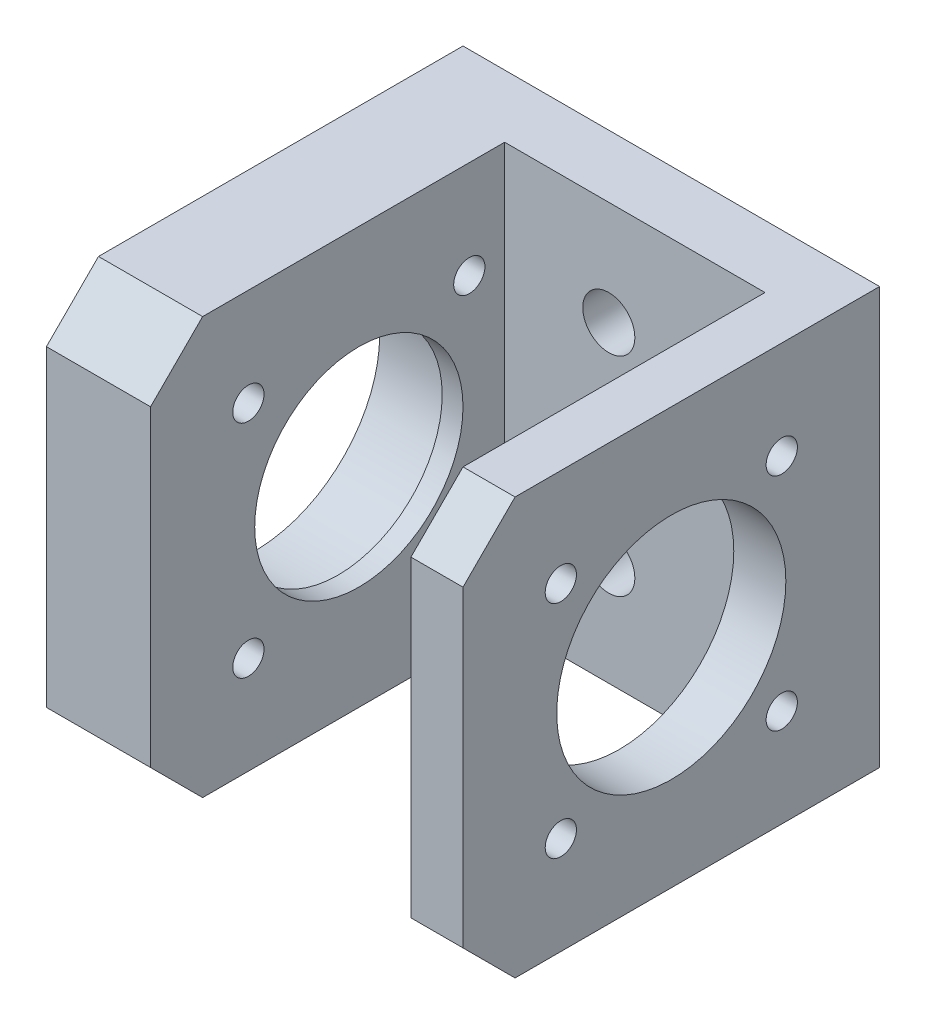
ISO-10303-21;
HEADER;
FILE_DESCRIPTION(('STEP AP214'),'2;1');
FILE_NAME('part.step','',(''),(''),'','','');
FILE_SCHEMA(('AUTOMOTIVE_DESIGN { 1 0 10303 214 1 1 1 1 }'));
ENDSEC;
DATA;
#1=APPLICATION_CONTEXT('core data for automotive mechanical design processes');
#2=APPLICATION_PROTOCOL_DEFINITION('international standard','automotive_design',2000,#1);
#3=PRODUCT_CONTEXT('',#1,'mechanical');
#4=PRODUCT('Part','Part','',(#3));
#5=PRODUCT_RELATED_PRODUCT_CATEGORY('part','',(#4));
#6=PRODUCT_DEFINITION_FORMATION('','',#4);
#7=PRODUCT_DEFINITION_CONTEXT('part definition',#1,'design');
#8=PRODUCT_DEFINITION('design','',#6,#7);
#9=PRODUCT_DEFINITION_SHAPE('','',#8);
#10=(LENGTH_UNIT() NAMED_UNIT(*) SI_UNIT(.MILLI.,.METRE.));
#11=(NAMED_UNIT(*) PLANE_ANGLE_UNIT() SI_UNIT($,.RADIAN.));
#12=(NAMED_UNIT(*) SI_UNIT($,.STERADIAN.) SOLID_ANGLE_UNIT());
#13=UNCERTAINTY_MEASURE_WITH_UNIT(LENGTH_MEASURE(1.E-05),#10,'distance_accuracy_value','');
#14=(GEOMETRIC_REPRESENTATION_CONTEXT(3) GLOBAL_UNCERTAINTY_ASSIGNED_CONTEXT((#13)) GLOBAL_UNIT_ASSIGNED_CONTEXT((#10,
#11,#12)) REPRESENTATION_CONTEXT('',''));
#15=CARTESIAN_POINT('',(0.,0.,0.));
#16=DIRECTION('',(0.,0.,1.));
#17=DIRECTION('',(1.,0.,0.));
#18=AXIS2_PLACEMENT_3D('',#15,#16,#17);
#19=CARTESIAN_POINT('',(-20.,20.,40.));
#20=DIRECTION('',(0.,-1.,0.));
#21=DIRECTION('',(0.,0.,-1.));
#22=AXIS2_PLACEMENT_3D('',#19,#20,#21);
#23=PLANE('',#22);
#24=DIRECTION('',(0.,0.,1.));
#25=VECTOR('',#24,1.);
#26=CARTESIAN_POINT('',(15.,20.,6.));
#27=LINE('',#26,#25);
#28=CARTESIAN_POINT('',(15.,20.,6.));
#29=VERTEX_POINT('',#28);
#30=CARTESIAN_POINT('',(15.,20.,35.));
#31=VERTEX_POINT('',#30);
#32=EDGE_CURVE('E162',#29,#31,#27,.T.);
#33=ORIENTED_EDGE('',*,*,#32,.T.);
#34=DIRECTION('',(1.,0.,0.));
#35=VECTOR('',#34,1.);
#36=CARTESIAN_POINT('',(-20.,20.,35.));
#37=LINE('',#36,#35);
#38=CARTESIAN_POINT('',(20.,20.,35.));
#39=VERTEX_POINT('',#38);
#40=EDGE_CURVE('E11',#31,#39,#37,.T.);
#41=ORIENTED_EDGE('',*,*,#40,.T.);
#42=DIRECTION('',(0.,0.,-1.));
#43=VECTOR('',#42,1.);
#44=CARTESIAN_POINT('',(20.,20.,40.));
#45=LINE('',#44,#43);
#46=CARTESIAN_POINT('',(20.,20.,0.));
#47=VERTEX_POINT('',#46);
#48=EDGE_CURVE('E175',#39,#47,#45,.T.);
#49=ORIENTED_EDGE('',*,*,#48,.T.);
#50=DIRECTION('',(-1.,0.,0.));
#51=VECTOR('',#50,1.);
#52=CARTESIAN_POINT('',(-20.,20.,0.));
#53=LINE('',#52,#51);
#54=CARTESIAN_POINT('',(-20.,20.,0.));
#55=VERTEX_POINT('',#54);
#56=EDGE_CURVE('E161',#47,#55,#53,.T.);
#57=ORIENTED_EDGE('',*,*,#56,.T.);
#58=DIRECTION('',(0.,0.,-1.));
#59=VECTOR('',#58,1.);
#60=CARTESIAN_POINT('',(-20.,20.,40.));
#61=LINE('',#60,#59);
#62=CARTESIAN_POINT('',(-20.,20.,35.));
#63=VERTEX_POINT('',#62);
#64=EDGE_CURVE('E173',#63,#55,#61,.T.);
#65=ORIENTED_EDGE('',*,*,#64,.F.);
#66=DIRECTION('',(1.,0.,0.));
#67=VECTOR('',#66,1.);
#68=CARTESIAN_POINT('',(-20.,20.,35.));
#69=LINE('',#68,#67);
#70=CARTESIAN_POINT('',(-10.,20.,35.));
#71=VERTEX_POINT('',#70);
#72=EDGE_CURVE('E41',#63,#71,#69,.T.);
#73=ORIENTED_EDGE('',*,*,#72,.T.);
#74=DIRECTION('',(0.,0.,1.));
#75=VECTOR('',#74,1.);
#76=CARTESIAN_POINT('',(-10.,20.,6.));
#77=LINE('',#76,#75);
#78=CARTESIAN_POINT('',(-10.,20.,6.));
#79=VERTEX_POINT('',#78);
#80=EDGE_CURVE('E126',#79,#71,#77,.T.);
#81=ORIENTED_EDGE('',*,*,#80,.F.);
#82=DIRECTION('',(-1.,0.,0.));
#83=VECTOR('',#82,1.);
#84=CARTESIAN_POINT('',(0.,20.,6.));
#85=LINE('',#84,#83);
#86=EDGE_CURVE('E134',#29,#79,#85,.T.);
#87=ORIENTED_EDGE('',*,*,#86,.F.);
#88=EDGE_LOOP('',(#33,#41,#49,#57,#65,#73,#81,#87));
#89=FACE_BOUND('',#88,.T.);
#90=ADVANCED_FACE('F32',(#89),#23,.F.);
#91=CARTESIAN_POINT('',(-20.,-20.,40.));
#92=DIRECTION('',(0.,1.,0.));
#93=DIRECTION('',(0.,0.,1.));
#94=AXIS2_PLACEMENT_3D('',#91,#92,#93);
#95=PLANE('',#94);
#96=DIRECTION('',(0.,0.,1.));
#97=VECTOR('',#96,1.);
#98=CARTESIAN_POINT('',(-9.99999999999999,-20.,6.));
#99=LINE('',#98,#97);
#100=CARTESIAN_POINT('',(-9.99999999999999,-20.,6.));
#101=VERTEX_POINT('',#100);
#102=CARTESIAN_POINT('',(-9.99999999999999,-20.,35.));
#103=VERTEX_POINT('',#102);
#104=EDGE_CURVE('E129',#101,#103,#99,.T.);
#105=ORIENTED_EDGE('',*,*,#104,.T.);
#106=DIRECTION('',(-1.,0.,0.));
#107=VECTOR('',#106,1.);
#108=CARTESIAN_POINT('',(-20.,-20.,35.));
#109=LINE('',#108,#107);
#110=CARTESIAN_POINT('',(-20.,-20.,35.));
#111=VERTEX_POINT('',#110);
#112=EDGE_CURVE('E189',#103,#111,#109,.T.);
#113=ORIENTED_EDGE('',*,*,#112,.T.);
#114=DIRECTION('',(0.,0.,-1.));
#115=VECTOR('',#114,1.);
#116=CARTESIAN_POINT('',(-20.,-20.,40.));
#117=LINE('',#116,#115);
#118=CARTESIAN_POINT('',(-20.,-20.,0.));
#119=VERTEX_POINT('',#118);
#120=EDGE_CURVE('E171',#111,#119,#117,.T.);
#121=ORIENTED_EDGE('',*,*,#120,.T.);
#122=DIRECTION('',(1.,0.,0.));
#123=VECTOR('',#122,1.);
#124=CARTESIAN_POINT('',(-20.,-20.,0.));
#125=LINE('',#124,#123);
#126=CARTESIAN_POINT('',(20.,-20.,0.));
#127=VERTEX_POINT('',#126);
#128=EDGE_CURVE('E154',#119,#127,#125,.T.);
#129=ORIENTED_EDGE('',*,*,#128,.T.);
#130=DIRECTION('',(0.,0.,-1.));
#131=VECTOR('',#130,1.);
#132=CARTESIAN_POINT('',(20.,-20.,40.));
#133=LINE('',#132,#131);
#134=CARTESIAN_POINT('',(20.,-20.,35.));
#135=VERTEX_POINT('',#134);
#136=EDGE_CURVE('E157',#135,#127,#133,.T.);
#137=ORIENTED_EDGE('',*,*,#136,.F.);
#138=DIRECTION('',(-1.,0.,0.));
#139=VECTOR('',#138,1.);
#140=CARTESIAN_POINT('',(-20.,-20.,35.));
#141=LINE('',#140,#139);
#142=CARTESIAN_POINT('',(15.,-20.,35.));
#143=VERTEX_POINT('',#142);
#144=EDGE_CURVE('E187',#135,#143,#141,.T.);
#145=ORIENTED_EDGE('',*,*,#144,.T.);
#146=DIRECTION('',(0.,0.,1.));
#147=VECTOR('',#146,1.);
#148=CARTESIAN_POINT('',(15.,-20.,6.));
#149=LINE('',#148,#147);
#150=CARTESIAN_POINT('',(15.,-20.,6.));
#151=VERTEX_POINT('',#150);
#152=EDGE_CURVE('E145',#151,#143,#149,.T.);
#153=ORIENTED_EDGE('',*,*,#152,.F.);
#154=DIRECTION('',(1.,0.,0.));
#155=VECTOR('',#154,1.);
#156=CARTESIAN_POINT('',(0.,-20.,6.));
#157=LINE('',#156,#155);
#158=EDGE_CURVE('E133',#101,#151,#157,.T.);
#159=ORIENTED_EDGE('',*,*,#158,.F.);
#160=EDGE_LOOP('',(#105,#113,#121,#129,#137,#145,#153,#159));
#161=FACE_BOUND('',#160,.T.);
#162=ADVANCED_FACE('F321',(#161),#95,.F.);
#163=CARTESIAN_POINT('',(0.,0.,40.));
#164=DIRECTION('',(0.,0.,-1.));
#165=DIRECTION('',(-1.,0.,0.));
#166=AXIS2_PLACEMENT_3D('',#163,#164,#165);
#167=PLANE('',#166);
#168=DIRECTION('',(0.,-1.,0.));
#169=VECTOR('',#168,1.);
#170=CARTESIAN_POINT('',(15.,0.,40.));
#171=LINE('',#170,#169);
#172=CARTESIAN_POINT('',(15.,15.,40.));
#173=VERTEX_POINT('',#172);
#174=CARTESIAN_POINT('',(15.,-15.,40.));
#175=VERTEX_POINT('',#174);
#176=EDGE_CURVE('E140',#173,#175,#171,.T.);
#177=ORIENTED_EDGE('',*,*,#176,.T.);
#178=DIRECTION('',(1.,0.,0.));
#179=VECTOR('',#178,1.);
#180=CARTESIAN_POINT('',(0.,-15.,40.));
#181=LINE('',#180,#179);
#182=CARTESIAN_POINT('',(20.,-15.,40.));
#183=VERTEX_POINT('',#182);
#184=EDGE_CURVE('E198',#175,#183,#181,.T.);
#185=ORIENTED_EDGE('',*,*,#184,.T.);
#186=DIRECTION('',(0.,1.,0.));
#187=VECTOR('',#186,1.);
#188=CARTESIAN_POINT('',(20.,-20.,40.));
#189=LINE('',#188,#187);
#190=CARTESIAN_POINT('',(20.,15.,40.));
#191=VERTEX_POINT('',#190);
#192=EDGE_CURVE('E150',#183,#191,#189,.T.);
#193=ORIENTED_EDGE('',*,*,#192,.T.);
#194=DIRECTION('',(-1.,0.,0.));
#195=VECTOR('',#194,1.);
#196=CARTESIAN_POINT('',(0.,15.,40.));
#197=LINE('',#196,#195);
#198=EDGE_CURVE('E195',#191,#173,#197,.T.);
#199=ORIENTED_EDGE('',*,*,#198,.T.);
#200=EDGE_LOOP('',(#177,#185,#193,#199));
#201=FACE_BOUND('',#200,.T.);
#202=ADVANCED_FACE('F303',(#201),#167,.F.);
#203=CARTESIAN_POINT('',(20.,-20.,40.));
#204=DIRECTION('',(-1.,0.,0.));
#205=DIRECTION('',(0.,0.,1.));
#206=AXIS2_PLACEMENT_3D('',#203,#204,#205);
#207=PLANE('',#206);
#208=CARTESIAN_POINT('',(20.,-10.6066017177982,30.6066017177982));
#209=DIRECTION('',(1.,0.,0.));
#210=DIRECTION('',(0.,0.,1.));
#211=AXIS2_PLACEMENT_3D('',#208,#209,#210);
#212=CIRCLE('',#211,1.5);
#213=CARTESIAN_POINT('',(20.,-10.6066017177982,32.1066017177982));
#214=VERTEX_POINT('',#213);
#215=EDGE_CURVE('E227',#214,#214,#212,.T.);
#216=ORIENTED_EDGE('',*,*,#215,.F.);
#217=EDGE_LOOP('',(#216));
#218=FACE_BOUND('',#217,.T.);
#219=CARTESIAN_POINT('',(20.,-10.6066017177981,9.39339828220168));
#220=DIRECTION('',(1.,0.,0.));
#221=DIRECTION('',(0.,-1.,0.));
#222=AXIS2_PLACEMENT_3D('',#219,#220,#221);
#223=CIRCLE('',#222,1.5);
#224=CARTESIAN_POINT('',(20.,-12.1066017177981,9.39339828220166));
#225=VERTEX_POINT('',#224);
#226=EDGE_CURVE('E237',#225,#225,#223,.T.);
#227=ORIENTED_EDGE('',*,*,#226,.F.);
#228=EDGE_LOOP('',(#227));
#229=FACE_BOUND('',#228,.T.);
#230=CARTESIAN_POINT('',(20.,10.6066017177982,30.6066017177982));
#231=DIRECTION('',(1.,0.,0.));
#232=DIRECTION('',(0.,1.,0.));
#233=AXIS2_PLACEMENT_3D('',#230,#231,#232);
#234=CIRCLE('',#233,1.5);
#235=CARTESIAN_POINT('',(20.,12.1066017177982,30.6066017177983));
#236=VERTEX_POINT('',#235);
#237=EDGE_CURVE('E243',#236,#236,#234,.T.);
#238=ORIENTED_EDGE('',*,*,#237,.F.);
#239=EDGE_LOOP('',(#238));
#240=FACE_BOUND('',#239,.T.);
#241=CARTESIAN_POINT('',(20.,10.6066017177982,9.39339828220179));
#242=DIRECTION('',(1.,0.,0.));
#243=DIRECTION('',(0.,0.,-1.));
#244=AXIS2_PLACEMENT_3D('',#241,#242,#243);
#245=CIRCLE('',#244,1.5);
#246=CARTESIAN_POINT('',(20.,10.6066017177982,7.89339828220179));
#247=VERTEX_POINT('',#246);
#248=EDGE_CURVE('E250',#247,#247,#245,.T.);
#249=ORIENTED_EDGE('',*,*,#248,.F.);
#250=EDGE_LOOP('',(#249));
#251=FACE_BOUND('',#250,.T.);
#252=CARTESIAN_POINT('',(20.,0.,20.));
#253=DIRECTION('',(1.,0.,0.));
#254=DIRECTION('',(0.,0.,-1.));
#255=AXIS2_PLACEMENT_3D('',#252,#253,#254);
#256=CIRCLE('',#255,11.);
#257=CARTESIAN_POINT('',(20.,0.,9.));
#258=VERTEX_POINT('',#257);
#259=EDGE_CURVE('E260',#258,#258,#256,.T.);
#260=ORIENTED_EDGE('',*,*,#259,.F.);
#261=EDGE_LOOP('',(#260));
#262=FACE_BOUND('',#261,.T.);
#263=ORIENTED_EDGE('',*,*,#192,.F.);
#264=DIRECTION('',(0.,0.707106781186547,0.707106781186549));
#265=VECTOR('',#264,1.);
#266=CARTESIAN_POINT('',(20.,-15.,40.));
#267=LINE('',#266,#265);
#268=EDGE_CURVE('E203',#183,#135,#267,.F.);
#269=ORIENTED_EDGE('',*,*,#268,.T.);
#270=ORIENTED_EDGE('',*,*,#136,.T.);
#271=DIRECTION('',(0.,1.,0.));
#272=VECTOR('',#271,1.);
#273=CARTESIAN_POINT('',(20.,-20.,0.));
#274=LINE('',#273,#272);
#275=EDGE_CURVE('E158',#127,#47,#274,.T.);
#276=ORIENTED_EDGE('',*,*,#275,.T.);
#277=ORIENTED_EDGE('',*,*,#48,.F.);
#278=DIRECTION('',(0.,0.707106781186547,-0.707106781186549));
#279=VECTOR('',#278,1.);
#280=CARTESIAN_POINT('',(20.,15.,40.));
#281=LINE('',#280,#279);
#282=EDGE_CURVE('E201',#39,#191,#281,.F.);
#283=ORIENTED_EDGE('',*,*,#282,.T.);
#284=EDGE_LOOP('',(#263,#269,#270,#276,#277,#283));
#285=FACE_BOUND('',#284,.T.);
#286=ADVANCED_FACE('F306',(#218,#229,#240,#251,#262,#285),#207,.F.);
#287=CARTESIAN_POINT('',(-20.,-20.,40.));
#288=DIRECTION('',(1.,0.,0.));
#289=DIRECTION('',(0.,0.,-1.));
#290=AXIS2_PLACEMENT_3D('',#287,#288,#289);
#291=PLANE('',#290);
#292=CARTESIAN_POINT('',(-20.,-10.6066017177982,30.6066017177982));
#293=DIRECTION('',(1.,0.,0.));
#294=DIRECTION('',(0.,0.,1.));
#295=AXIS2_PLACEMENT_3D('',#292,#293,#294);
#296=CIRCLE('',#295,1.5);
#297=CARTESIAN_POINT('',(-20.,-10.6066017177982,32.1066017177982));
#298=VERTEX_POINT('',#297);
#299=EDGE_CURVE('E221',#298,#298,#296,.T.);
#300=ORIENTED_EDGE('',*,*,#299,.T.);
#301=EDGE_LOOP('',(#300));
#302=FACE_BOUND('',#301,.T.);
#303=CARTESIAN_POINT('',(-20.,-10.6066017177981,9.39339828220168));
#304=DIRECTION('',(1.,0.,0.));
#305=DIRECTION('',(0.,-1.,0.));
#306=AXIS2_PLACEMENT_3D('',#303,#304,#305);
#307=CIRCLE('',#306,1.5);
#308=CARTESIAN_POINT('',(-20.,-12.1066017177981,9.39339828220166));
#309=VERTEX_POINT('',#308);
#310=EDGE_CURVE('E232',#309,#309,#307,.T.);
#311=ORIENTED_EDGE('',*,*,#310,.T.);
#312=EDGE_LOOP('',(#311));
#313=FACE_BOUND('',#312,.T.);
#314=CARTESIAN_POINT('',(-20.,10.6066017177982,30.6066017177982));
#315=DIRECTION('',(1.,0.,0.));
#316=DIRECTION('',(0.,1.,0.));
#317=AXIS2_PLACEMENT_3D('',#314,#315,#316);
#318=CIRCLE('',#317,1.5);
#319=CARTESIAN_POINT('',(-20.,12.1066017177982,30.6066017177983));
#320=VERTEX_POINT('',#319);
#321=EDGE_CURVE('E217',#320,#320,#318,.T.);
#322=ORIENTED_EDGE('',*,*,#321,.T.);
#323=EDGE_LOOP('',(#322));
#324=FACE_BOUND('',#323,.T.);
#325=CARTESIAN_POINT('',(-20.,10.6066017177982,9.39339828220179));
#326=DIRECTION('',(1.,0.,0.));
#327=DIRECTION('',(0.,0.,-1.));
#328=AXIS2_PLACEMENT_3D('',#325,#326,#327);
#329=CIRCLE('',#328,1.5);
#330=CARTESIAN_POINT('',(-20.,10.6066017177982,7.89339828220179));
#331=VERTEX_POINT('',#330);
#332=EDGE_CURVE('E213',#331,#331,#329,.T.);
#333=ORIENTED_EDGE('',*,*,#332,.T.);
#334=EDGE_LOOP('',(#333));
#335=FACE_BOUND('',#334,.T.);
#336=CARTESIAN_POINT('',(-20.,0.,20.));
#337=DIRECTION('',(-1.,0.,0.));
#338=DIRECTION('',(0.,0.,1.));
#339=AXIS2_PLACEMENT_3D('',#336,#337,#338);
#340=CIRCLE('',#339,12.);
#341=CARTESIAN_POINT('',(-20.,0.,32.));
#342=VERTEX_POINT('',#341);
#343=EDGE_CURVE('E269',#342,#342,#340,.T.);
#344=ORIENTED_EDGE('',*,*,#343,.F.);
#345=EDGE_LOOP('',(#344));
#346=FACE_BOUND('',#345,.T.);
#347=ORIENTED_EDGE('',*,*,#120,.F.);
#348=DIRECTION('',(0.,-0.707106781186547,-0.707106781186549));
#349=VECTOR('',#348,1.);
#350=CARTESIAN_POINT('',(-20.,-15.,40.));
#351=LINE('',#350,#349);
#352=CARTESIAN_POINT('',(-20.,-15.,40.));
#353=VERTEX_POINT('',#352);
#354=EDGE_CURVE('E193',#111,#353,#351,.F.);
#355=ORIENTED_EDGE('',*,*,#354,.T.);
#356=DIRECTION('',(0.,-1.,0.));
#357=VECTOR('',#356,1.);
#358=CARTESIAN_POINT('',(-20.,-20.,40.));
#359=LINE('',#358,#357);
#360=CARTESIAN_POINT('',(-20.,15.,40.));
#361=VERTEX_POINT('',#360);
#362=EDGE_CURVE('E153',#361,#353,#359,.T.);
#363=ORIENTED_EDGE('',*,*,#362,.F.);
#364=DIRECTION('',(0.,-0.707106781186547,0.707106781186549));
#365=VECTOR('',#364,1.);
#366=CARTESIAN_POINT('',(-20.,15.,40.));
#367=LINE('',#366,#365);
#368=EDGE_CURVE('E191',#361,#63,#367,.F.);
#369=ORIENTED_EDGE('',*,*,#368,.T.);
#370=ORIENTED_EDGE('',*,*,#64,.T.);
#371=DIRECTION('',(0.,-1.,0.));
#372=VECTOR('',#371,1.);
#373=CARTESIAN_POINT('',(-20.,-20.,0.));
#374=LINE('',#373,#372);
#375=EDGE_CURVE('E165',#55,#119,#374,.T.);
#376=ORIENTED_EDGE('',*,*,#375,.T.);
#377=EDGE_LOOP('',(#347,#355,#363,#369,#370,#376));
#378=FACE_BOUND('',#377,.T.);
#379=ADVANCED_FACE('F329',(#302,#313,#324,#335,#346,#378),#291,.F.);
#380=ORIENTED_EDGE('',*,*,#362,.T.);
#381=DIRECTION('',(1.,0.,0.));
#382=VECTOR('',#381,1.);
#383=CARTESIAN_POINT('',(0.,-15.,40.));
#384=LINE('',#383,#382);
#385=CARTESIAN_POINT('',(-10.,-15.,40.));
#386=VERTEX_POINT('',#385);
#387=EDGE_CURVE('E180',#353,#386,#384,.T.);
#388=ORIENTED_EDGE('',*,*,#387,.T.);
#389=DIRECTION('',(0.,-1.,0.));
#390=VECTOR('',#389,1.);
#391=CARTESIAN_POINT('',(-10.,0.,40.));
#392=LINE('',#391,#390);
#393=CARTESIAN_POINT('',(-10.,15.,40.));
#394=VERTEX_POINT('',#393);
#395=EDGE_CURVE('E285',#394,#386,#392,.T.);
#396=ORIENTED_EDGE('',*,*,#395,.F.);
#397=DIRECTION('',(-1.,0.,0.));
#398=VECTOR('',#397,1.);
#399=CARTESIAN_POINT('',(0.,15.,40.));
#400=LINE('',#399,#398);
#401=EDGE_CURVE('E177',#394,#361,#400,.T.);
#402=ORIENTED_EDGE('',*,*,#401,.T.);
#403=EDGE_LOOP('',(#380,#388,#396,#402));
#404=FACE_BOUND('',#403,.T.);
#405=ADVANCED_FACE('F349',(#404),#167,.F.);
#406=CARTESIAN_POINT('',(0.,0.,0.));
#407=DIRECTION('',(0.,0.,-1.));
#408=DIRECTION('',(-1.,0.,0.));
#409=AXIS2_PLACEMENT_3D('',#406,#407,#408);
#410=PLANE('',#409);
#411=CARTESIAN_POINT('',(0.,-10.,0.));
#412=DIRECTION('',(0.,0.,1.));
#413=DIRECTION('',(1.,0.,0.));
#414=AXIS2_PLACEMENT_3D('',#411,#412,#413);
#415=CIRCLE('',#414,2.5);
#416=CARTESIAN_POINT('',(2.5,-10.,0.));
#417=VERTEX_POINT('',#416);
#418=EDGE_CURVE('E276',#417,#417,#415,.T.);
#419=ORIENTED_EDGE('',*,*,#418,.T.);
#420=EDGE_LOOP('',(#419));
#421=FACE_BOUND('',#420,.T.);
#422=CARTESIAN_POINT('',(0.,10.,0.));
#423=DIRECTION('',(0.,0.,1.));
#424=DIRECTION('',(1.,0.,0.));
#425=AXIS2_PLACEMENT_3D('',#422,#423,#424);
#426=CIRCLE('',#425,2.5);
#427=CARTESIAN_POINT('',(2.5,10.,0.));
#428=VERTEX_POINT('',#427);
#429=EDGE_CURVE('E282',#428,#428,#426,.T.);
#430=ORIENTED_EDGE('',*,*,#429,.T.);
#431=EDGE_LOOP('',(#430));
#432=FACE_BOUND('',#431,.T.);
#433=ORIENTED_EDGE('',*,*,#275,.F.);
#434=ORIENTED_EDGE('',*,*,#128,.F.);
#435=ORIENTED_EDGE('',*,*,#375,.F.);
#436=ORIENTED_EDGE('',*,*,#56,.F.);
#437=EDGE_LOOP('',(#433,#434,#435,#436));
#438=FACE_BOUND('',#437,.T.);
#439=ADVANCED_FACE('F357',(#421,#432,#438),#410,.T.);
#440=CARTESIAN_POINT('',(15.,0.,6.));
#441=DIRECTION('',(-1.,0.,0.));
#442=DIRECTION('',(0.,-1.,0.));
#443=AXIS2_PLACEMENT_3D('',#440,#441,#442);
#444=PLANE('',#443);
#445=CARTESIAN_POINT('',(15.,-10.6066017177982,30.6066017177982));
#446=DIRECTION('',(-1.,0.,0.));
#447=DIRECTION('',(0.,-1.,0.));
#448=AXIS2_PLACEMENT_3D('',#445,#446,#447);
#449=CIRCLE('',#448,1.5);
#450=CARTESIAN_POINT('',(15.,-12.1066017177982,30.6066017177982));
#451=VERTEX_POINT('',#450);
#452=EDGE_CURVE('E240',#451,#451,#449,.T.);
#453=ORIENTED_EDGE('',*,*,#452,.F.);
#454=EDGE_LOOP('',(#453));
#455=FACE_BOUND('',#454,.T.);
#456=CARTESIAN_POINT('',(15.,-10.6066017177981,9.39339828220168));
#457=DIRECTION('',(-1.,0.,0.));
#458=DIRECTION('',(0.,-1.,0.));
#459=AXIS2_PLACEMENT_3D('',#456,#457,#458);
#460=CIRCLE('',#459,1.5);
#461=CARTESIAN_POINT('',(15.,-12.1066017177981,9.39339828220168));
#462=VERTEX_POINT('',#461);
#463=EDGE_CURVE('E220',#462,#462,#460,.T.);
#464=ORIENTED_EDGE('',*,*,#463,.F.);
#465=EDGE_LOOP('',(#464));
#466=FACE_BOUND('',#465,.T.);
#467=CARTESIAN_POINT('',(15.,10.6066017177982,30.6066017177982));
#468=DIRECTION('',(-1.,0.,0.));
#469=DIRECTION('',(0.,-1.,0.));
#470=AXIS2_PLACEMENT_3D('',#467,#468,#469);
#471=CIRCLE('',#470,1.5);
#472=CARTESIAN_POINT('',(15.,9.10660171779818,30.6066017177982));
#473=VERTEX_POINT('',#472);
#474=EDGE_CURVE('E216',#473,#473,#471,.T.);
#475=ORIENTED_EDGE('',*,*,#474,.F.);
#476=EDGE_LOOP('',(#475));
#477=FACE_BOUND('',#476,.T.);
#478=CARTESIAN_POINT('',(15.,10.6066017177982,9.39339828220179));
#479=DIRECTION('',(-1.,0.,0.));
#480=DIRECTION('',(0.,-1.,0.));
#481=AXIS2_PLACEMENT_3D('',#478,#479,#480);
#482=CIRCLE('',#481,1.5);
#483=CARTESIAN_POINT('',(15.,9.10660171779821,9.39339828220179));
#484=VERTEX_POINT('',#483);
#485=EDGE_CURVE('E212',#484,#484,#482,.T.);
#486=ORIENTED_EDGE('',*,*,#485,.F.);
#487=EDGE_LOOP('',(#486));
#488=FACE_BOUND('',#487,.T.);
#489=CARTESIAN_POINT('',(15.,0.,20.));
#490=DIRECTION('',(-1.,0.,0.));
#491=DIRECTION('',(0.,-1.,0.));
#492=AXIS2_PLACEMENT_3D('',#489,#490,#491);
#493=CIRCLE('',#492,11.);
#494=CARTESIAN_POINT('',(15.,-11.,20.));
#495=VERTEX_POINT('',#494);
#496=EDGE_CURVE('E257',#495,#495,#493,.F.);
#497=ORIENTED_EDGE('',*,*,#496,.T.);
#498=EDGE_LOOP('',(#497));
#499=FACE_BOUND('',#498,.T.);
#500=ORIENTED_EDGE('',*,*,#152,.T.);
#501=DIRECTION('',(0.,-0.707106781186547,-0.707106781186549));
#502=VECTOR('',#501,1.);
#503=CARTESIAN_POINT('',(15.,-24.5,30.5));
#504=LINE('',#503,#502);
#505=EDGE_CURVE('E206',#143,#175,#504,.F.);
#506=ORIENTED_EDGE('',*,*,#505,.T.);
#507=ORIENTED_EDGE('',*,*,#176,.F.);
#508=DIRECTION('',(0.,-0.707106781186547,0.707106781186549));
#509=VECTOR('',#508,1.);
#510=CARTESIAN_POINT('',(15.,24.5,30.5));
#511=LINE('',#510,#509);
#512=EDGE_CURVE('E49',#173,#31,#511,.F.);
#513=ORIENTED_EDGE('',*,*,#512,.T.);
#514=ORIENTED_EDGE('',*,*,#32,.F.);
#515=DIRECTION('',(0.,-1.,0.));
#516=VECTOR('',#515,1.);
#517=CARTESIAN_POINT('',(15.,0.,6.));
#518=LINE('',#517,#516);
#519=EDGE_CURVE('E139',#29,#151,#518,.T.);
#520=ORIENTED_EDGE('',*,*,#519,.T.);
#521=EDGE_LOOP('',(#500,#506,#507,#513,#514,#520));
#522=FACE_BOUND('',#521,.T.);
#523=ADVANCED_FACE('F295',(#455,#466,#477,#488,#499,#522),#444,.T.);
#524=CARTESIAN_POINT('',(-10.,0.,6.));
#525=DIRECTION('',(-1.,0.,0.));
#526=DIRECTION('',(0.,-1.,0.));
#527=AXIS2_PLACEMENT_3D('',#524,#525,#526);
#528=PLANE('',#527);
#529=CARTESIAN_POINT('',(-10.,-10.6066017177982,30.6066017177982));
#530=DIRECTION('',(-1.,0.,0.));
#531=DIRECTION('',(0.,-1.,0.));
#532=AXIS2_PLACEMENT_3D('',#529,#530,#531);
#533=CIRCLE('',#532,1.5);
#534=CARTESIAN_POINT('',(-10.,-12.1066017177982,30.6066017177982));
#535=VERTEX_POINT('',#534);
#536=EDGE_CURVE('E36',#535,#535,#533,.T.);
#537=ORIENTED_EDGE('',*,*,#536,.T.);
#538=EDGE_LOOP('',(#537));
#539=FACE_BOUND('',#538,.T.);
#540=CARTESIAN_POINT('',(-10.,-10.6066017177981,9.39339828220168));
#541=DIRECTION('',(-1.,0.,0.));
#542=DIRECTION('',(0.,-1.,0.));
#543=AXIS2_PLACEMENT_3D('',#540,#541,#542);
#544=CIRCLE('',#543,1.5);
#545=CARTESIAN_POINT('',(-10.,-12.1066017177981,9.39339828220168));
#546=VERTEX_POINT('',#545);
#547=EDGE_CURVE('E218',#546,#546,#544,.T.);
#548=ORIENTED_EDGE('',*,*,#547,.T.);
#549=EDGE_LOOP('',(#548));
#550=FACE_BOUND('',#549,.T.);
#551=CARTESIAN_POINT('',(-10.,10.6066017177982,30.6066017177982));
#552=DIRECTION('',(-1.,0.,0.));
#553=DIRECTION('',(0.,-1.,0.));
#554=AXIS2_PLACEMENT_3D('',#551,#552,#553);
#555=CIRCLE('',#554,1.5);
#556=CARTESIAN_POINT('',(-10.,9.10660171779818,30.6066017177982));
#557=VERTEX_POINT('',#556);
#558=EDGE_CURVE('E214',#557,#557,#555,.T.);
#559=ORIENTED_EDGE('',*,*,#558,.T.);
#560=EDGE_LOOP('',(#559));
#561=FACE_BOUND('',#560,.T.);
#562=CARTESIAN_POINT('',(-10.,10.6066017177982,9.39339828220179));
#563=DIRECTION('',(-1.,0.,0.));
#564=DIRECTION('',(0.,-1.,0.));
#565=AXIS2_PLACEMENT_3D('',#562,#563,#564);
#566=CIRCLE('',#565,1.5);
#567=CARTESIAN_POINT('',(-10.,9.10660171779821,9.39339828220179));
#568=VERTEX_POINT('',#567);
#569=EDGE_CURVE('E209',#568,#568,#566,.T.);
#570=ORIENTED_EDGE('',*,*,#569,.T.);
#571=EDGE_LOOP('',(#570));
#572=FACE_BOUND('',#571,.T.);
#573=CARTESIAN_POINT('',(-10.,0.,20.));
#574=DIRECTION('',(-1.,0.,0.));
#575=DIRECTION('',(0.,-1.,0.));
#576=AXIS2_PLACEMENT_3D('',#573,#574,#575);
#577=CIRCLE('',#576,10.);
#578=CARTESIAN_POINT('',(-10.,-10.,20.));
#579=VERTEX_POINT('',#578);
#580=EDGE_CURVE('E266',#579,#579,#577,.F.);
#581=ORIENTED_EDGE('',*,*,#580,.F.);
#582=EDGE_LOOP('',(#581));
#583=FACE_BOUND('',#582,.T.);
#584=ORIENTED_EDGE('',*,*,#395,.T.);
#585=DIRECTION('',(0.,0.707106781186547,0.707106781186549));
#586=VECTOR('',#585,1.);
#587=CARTESIAN_POINT('',(-10.,-15.,40.));
#588=LINE('',#587,#586);
#589=EDGE_CURVE('E185',#386,#103,#588,.F.);
#590=ORIENTED_EDGE('',*,*,#589,.T.);
#591=ORIENTED_EDGE('',*,*,#104,.F.);
#592=DIRECTION('',(0.,-1.,0.));
#593=VECTOR('',#592,1.);
#594=CARTESIAN_POINT('',(-10.,0.,6.));
#595=LINE('',#594,#593);
#596=EDGE_CURVE('E121',#79,#101,#595,.T.);
#597=ORIENTED_EDGE('',*,*,#596,.F.);
#598=ORIENTED_EDGE('',*,*,#80,.T.);
#599=DIRECTION('',(0.,0.707106781186547,-0.707106781186549));
#600=VECTOR('',#599,1.);
#601=CARTESIAN_POINT('',(-10.,15.,40.));
#602=LINE('',#601,#600);
#603=EDGE_CURVE('E183',#71,#394,#602,.F.);
#604=ORIENTED_EDGE('',*,*,#603,.T.);
#605=EDGE_LOOP('',(#584,#590,#591,#597,#598,#604));
#606=FACE_BOUND('',#605,.T.);
#607=ADVANCED_FACE('F124',(#539,#550,#561,#572,#583,#606),#528,.F.);
#608=CARTESIAN_POINT('',(0.,0.,6.));
#609=DIRECTION('',(0.,0.,1.));
#610=DIRECTION('',(1.,0.,0.));
#611=AXIS2_PLACEMENT_3D('',#608,#609,#610);
#612=PLANE('',#611);
#613=CARTESIAN_POINT('',(0.,-10.,6.));
#614=DIRECTION('',(0.,0.,1.));
#615=DIRECTION('',(1.,0.,0.));
#616=AXIS2_PLACEMENT_3D('',#613,#614,#615);
#617=CIRCLE('',#616,2.5);
#618=CARTESIAN_POINT('',(2.5,-10.,6.));
#619=VERTEX_POINT('',#618);
#620=EDGE_CURVE('E273',#619,#619,#617,.T.);
#621=ORIENTED_EDGE('',*,*,#620,.F.);
#622=EDGE_LOOP('',(#621));
#623=FACE_BOUND('',#622,.T.);
#624=CARTESIAN_POINT('',(0.,10.,6.));
#625=DIRECTION('',(0.,0.,1.));
#626=DIRECTION('',(1.,0.,0.));
#627=AXIS2_PLACEMENT_3D('',#624,#625,#626);
#628=CIRCLE('',#627,2.5);
#629=CARTESIAN_POINT('',(2.5,10.,6.));
#630=VERTEX_POINT('',#629);
#631=EDGE_CURVE('E279',#630,#630,#628,.T.);
#632=ORIENTED_EDGE('',*,*,#631,.F.);
#633=EDGE_LOOP('',(#632));
#634=FACE_BOUND('',#633,.T.);
#635=ORIENTED_EDGE('',*,*,#86,.T.);
#636=ORIENTED_EDGE('',*,*,#596,.T.);
#637=ORIENTED_EDGE('',*,*,#158,.T.);
#638=ORIENTED_EDGE('',*,*,#519,.F.);
#639=EDGE_LOOP('',(#635,#636,#637,#638));
#640=FACE_BOUND('',#639,.T.);
#641=ADVANCED_FACE('F138',(#623,#634,#640),#612,.T.);
#642=CARTESIAN_POINT('',(0.,10.,0.));
#643=DIRECTION('',(0.,0.,1.));
#644=DIRECTION('',(1.,0.,0.));
#645=AXIS2_PLACEMENT_3D('',#642,#643,#644);
#646=CYLINDRICAL_SURFACE('',#645,2.5);
#647=ORIENTED_EDGE('',*,*,#429,.F.);
#648=EDGE_LOOP('',(#647));
#649=FACE_BOUND('',#648,.T.);
#650=ORIENTED_EDGE('',*,*,#631,.T.);
#651=EDGE_LOOP('',(#650));
#652=FACE_BOUND('',#651,.T.);
#653=ADVANCED_FACE('F339',(#649,#652),#646,.F.);
#654=CARTESIAN_POINT('',(0.,-10.,0.));
#655=DIRECTION('',(0.,0.,1.));
#656=DIRECTION('',(1.,0.,0.));
#657=AXIS2_PLACEMENT_3D('',#654,#655,#656);
#658=CYLINDRICAL_SURFACE('',#657,2.5);
#659=ORIENTED_EDGE('',*,*,#418,.F.);
#660=EDGE_LOOP('',(#659));
#661=FACE_BOUND('',#660,.T.);
#662=ORIENTED_EDGE('',*,*,#620,.T.);
#663=EDGE_LOOP('',(#662));
#664=FACE_BOUND('',#663,.T.);
#665=ADVANCED_FACE('F334',(#661,#664),#658,.F.);
#666=CARTESIAN_POINT('',(0.,-15.,40.));
#667=DIRECTION('',(0.,0.707106781186548,-0.707106781186546));
#668=DIRECTION('',(1.,0.,0.));
#669=AXIS2_PLACEMENT_3D('',#666,#667,#668);
#670=PLANE('',#669);
#671=ORIENTED_EDGE('',*,*,#354,.F.);
#672=ORIENTED_EDGE('',*,*,#112,.F.);
#673=ORIENTED_EDGE('',*,*,#589,.F.);
#674=ORIENTED_EDGE('',*,*,#387,.F.);
#675=EDGE_LOOP('',(#671,#672,#673,#674));
#676=FACE_BOUND('',#675,.T.);
#677=ADVANCED_FACE('F318',(#676),#670,.F.);
#678=CARTESIAN_POINT('',(0.,-15.,40.));
#679=DIRECTION('',(0.,0.707106781186548,-0.707106781186546));
#680=DIRECTION('',(1.,0.,0.));
#681=AXIS2_PLACEMENT_3D('',#678,#679,#680);
#682=PLANE('',#681);
#683=ORIENTED_EDGE('',*,*,#505,.F.);
#684=ORIENTED_EDGE('',*,*,#144,.F.);
#685=ORIENTED_EDGE('',*,*,#268,.F.);
#686=ORIENTED_EDGE('',*,*,#184,.F.);
#687=EDGE_LOOP('',(#683,#684,#685,#686));
#688=FACE_BOUND('',#687,.T.);
#689=ADVANCED_FACE('F300',(#688),#682,.F.);
#690=CARTESIAN_POINT('',(0.,15.,40.));
#691=DIRECTION('',(0.,-0.707106781186548,-0.707106781186546));
#692=DIRECTION('',(-1.,0.,0.));
#693=AXIS2_PLACEMENT_3D('',#690,#691,#692);
#694=PLANE('',#693);
#695=ORIENTED_EDGE('',*,*,#282,.F.);
#696=ORIENTED_EDGE('',*,*,#40,.F.);
#697=ORIENTED_EDGE('',*,*,#512,.F.);
#698=ORIENTED_EDGE('',*,*,#198,.F.);
#699=EDGE_LOOP('',(#695,#696,#697,#698));
#700=FACE_BOUND('',#699,.T.);
#701=ADVANCED_FACE('F310',(#700),#694,.F.);
#702=CARTESIAN_POINT('',(0.,15.,40.));
#703=DIRECTION('',(0.,-0.707106781186548,-0.707106781186546));
#704=DIRECTION('',(-1.,0.,0.));
#705=AXIS2_PLACEMENT_3D('',#702,#703,#704);
#706=PLANE('',#705);
#707=ORIENTED_EDGE('',*,*,#603,.F.);
#708=ORIENTED_EDGE('',*,*,#72,.F.);
#709=ORIENTED_EDGE('',*,*,#368,.F.);
#710=ORIENTED_EDGE('',*,*,#401,.F.);
#711=EDGE_LOOP('',(#707,#708,#709,#710));
#712=FACE_BOUND('',#711,.T.);
#713=ADVANCED_FACE('F34',(#712),#706,.F.);
#714=CARTESIAN_POINT('',(-12.,0.,20.));
#715=DIRECTION('',(-1.,0.,0.));
#716=DIRECTION('',(0.,0.,1.));
#717=AXIS2_PLACEMENT_3D('',#714,#715,#716);
#718=CYLINDRICAL_SURFACE('',#717,12.);
#719=CARTESIAN_POINT('',(-12.,0.,20.));
#720=DIRECTION('',(-1.,0.,0.));
#721=DIRECTION('',(0.,0.,1.));
#722=AXIS2_PLACEMENT_3D('',#719,#720,#721);
#723=CIRCLE('',#722,12.);
#724=CARTESIAN_POINT('',(-12.,0.,32.));
#725=VERTEX_POINT('',#724);
#726=EDGE_CURVE('E270',#725,#725,#723,.T.);
#727=ORIENTED_EDGE('',*,*,#726,.F.);
#728=EDGE_LOOP('',(#727));
#729=FACE_BOUND('',#728,.T.);
#730=ORIENTED_EDGE('',*,*,#343,.T.);
#731=EDGE_LOOP('',(#730));
#732=FACE_BOUND('',#731,.T.);
#733=ADVANCED_FACE('F316',(#729,#732),#718,.F.);
#734=CARTESIAN_POINT('',(-12.,0.,20.));
#735=DIRECTION('',(-1.,0.,0.));
#736=DIRECTION('',(0.,0.,1.));
#737=AXIS2_PLACEMENT_3D('',#734,#735,#736);
#738=PLANE('',#737);
#739=CARTESIAN_POINT('',(-12.,0.,20.));
#740=DIRECTION('',(-1.,0.,0.));
#741=DIRECTION('',(0.,0.,1.));
#742=AXIS2_PLACEMENT_3D('',#739,#740,#741);
#743=CIRCLE('',#742,10.);
#744=CARTESIAN_POINT('',(-12.,0.,30.));
#745=VERTEX_POINT('',#744);
#746=EDGE_CURVE('E263',#745,#745,#743,.T.);
#747=ORIENTED_EDGE('',*,*,#746,.F.);
#748=EDGE_LOOP('',(#747));
#749=FACE_BOUND('',#748,.T.);
#750=ORIENTED_EDGE('',*,*,#726,.T.);
#751=EDGE_LOOP('',(#750));
#752=FACE_BOUND('',#751,.T.);
#753=ADVANCED_FACE('F381',(#749,#752),#738,.T.);
#754=CARTESIAN_POINT('',(20.001,0.,20.));
#755=DIRECTION('',(-1.,0.,0.));
#756=DIRECTION('',(0.,0.,1.));
#757=AXIS2_PLACEMENT_3D('',#754,#755,#756);
#758=CYLINDRICAL_SURFACE('',#757,10.);
#759=ORIENTED_EDGE('',*,*,#746,.T.);
#760=EDGE_LOOP('',(#759));
#761=FACE_BOUND('',#760,.T.);
#762=ORIENTED_EDGE('',*,*,#580,.T.);
#763=EDGE_LOOP('',(#762));
#764=FACE_BOUND('',#763,.T.);
#765=ADVANCED_FACE('F385',(#761,#764),#758,.F.);
#766=CARTESIAN_POINT('',(-20.001,0.,20.));
#767=DIRECTION('',(1.,0.,0.));
#768=DIRECTION('',(0.,0.,-1.));
#769=AXIS2_PLACEMENT_3D('',#766,#767,#768);
#770=CYLINDRICAL_SURFACE('',#769,11.);
#771=ORIENTED_EDGE('',*,*,#496,.F.);
#772=EDGE_LOOP('',(#771));
#773=FACE_BOUND('',#772,.T.);
#774=ORIENTED_EDGE('',*,*,#259,.T.);
#775=EDGE_LOOP('',(#774));
#776=FACE_BOUND('',#775,.T.);
#777=ADVANCED_FACE('F389',(#773,#776),#770,.F.);
#778=CARTESIAN_POINT('',(-20.,10.6066017177982,9.39339828220179));
#779=DIRECTION('',(1.,0.,0.));
#780=DIRECTION('',(0.,0.,-1.));
#781=AXIS2_PLACEMENT_3D('',#778,#779,#780);
#782=CYLINDRICAL_SURFACE('',#781,1.5);
#783=ORIENTED_EDGE('',*,*,#332,.F.);
#784=EDGE_LOOP('',(#783));
#785=FACE_BOUND('',#784,.T.);
#786=ORIENTED_EDGE('',*,*,#569,.F.);
#787=EDGE_LOOP('',(#786));
#788=FACE_BOUND('',#787,.T.);
#789=ADVANCED_FACE('F393',(#785,#788),#782,.F.);
#790=ORIENTED_EDGE('',*,*,#485,.T.);
#791=EDGE_LOOP('',(#790));
#792=FACE_BOUND('',#791,.T.);
#793=ORIENTED_EDGE('',*,*,#248,.T.);
#794=EDGE_LOOP('',(#793));
#795=FACE_BOUND('',#794,.T.);
#796=ADVANCED_FACE('F395',(#792,#795),#782,.F.);
#797=CARTESIAN_POINT('',(-20.,10.6066017177982,30.6066017177982));
#798=DIRECTION('',(1.,0.,0.));
#799=DIRECTION('',(0.,0.,-1.));
#800=AXIS2_PLACEMENT_3D('',#797,#798,#799);
#801=CYLINDRICAL_SURFACE('',#800,1.5);
#802=ORIENTED_EDGE('',*,*,#321,.F.);
#803=EDGE_LOOP('',(#802));
#804=FACE_BOUND('',#803,.T.);
#805=ORIENTED_EDGE('',*,*,#558,.F.);
#806=EDGE_LOOP('',(#805));
#807=FACE_BOUND('',#806,.T.);
#808=ADVANCED_FACE('F398',(#804,#807),#801,.F.);
#809=ORIENTED_EDGE('',*,*,#474,.T.);
#810=EDGE_LOOP('',(#809));
#811=FACE_BOUND('',#810,.T.);
#812=ORIENTED_EDGE('',*,*,#237,.T.);
#813=EDGE_LOOP('',(#812));
#814=FACE_BOUND('',#813,.T.);
#815=ADVANCED_FACE('F400',(#811,#814),#801,.F.);
#816=CARTESIAN_POINT('',(-20.,-10.6066017177981,9.39339828220168));
#817=DIRECTION('',(1.,0.,0.));
#818=DIRECTION('',(0.,0.,-1.));
#819=AXIS2_PLACEMENT_3D('',#816,#817,#818);
#820=CYLINDRICAL_SURFACE('',#819,1.5);
#821=ORIENTED_EDGE('',*,*,#310,.F.);
#822=EDGE_LOOP('',(#821));
#823=FACE_BOUND('',#822,.T.);
#824=ORIENTED_EDGE('',*,*,#547,.F.);
#825=EDGE_LOOP('',(#824));
#826=FACE_BOUND('',#825,.T.);
#827=ADVANCED_FACE('F403',(#823,#826),#820,.F.);
#828=CARTESIAN_POINT('',(-20.,-10.6066017177982,30.6066017177982));
#829=DIRECTION('',(1.,0.,0.));
#830=DIRECTION('',(0.,0.,-1.));
#831=AXIS2_PLACEMENT_3D('',#828,#829,#830);
#832=CYLINDRICAL_SURFACE('',#831,1.5);
#833=ORIENTED_EDGE('',*,*,#299,.F.);
#834=EDGE_LOOP('',(#833));
#835=FACE_BOUND('',#834,.T.);
#836=ORIENTED_EDGE('',*,*,#536,.F.);
#837=EDGE_LOOP('',(#836));
#838=FACE_BOUND('',#837,.T.);
#839=ADVANCED_FACE('F409',(#835,#838),#832,.F.);
#840=ORIENTED_EDGE('',*,*,#463,.T.);
#841=EDGE_LOOP('',(#840));
#842=FACE_BOUND('',#841,.T.);
#843=ORIENTED_EDGE('',*,*,#226,.T.);
#844=EDGE_LOOP('',(#843));
#845=FACE_BOUND('',#844,.T.);
#846=ADVANCED_FACE('F405',(#842,#845),#820,.F.);
#847=ORIENTED_EDGE('',*,*,#452,.T.);
#848=EDGE_LOOP('',(#847));
#849=FACE_BOUND('',#848,.T.);
#850=ORIENTED_EDGE('',*,*,#215,.T.);
#851=EDGE_LOOP('',(#850));
#852=FACE_BOUND('',#851,.T.);
#853=ADVANCED_FACE('F408',(#849,#852),#832,.F.);
#854=CLOSED_SHELL('',(#90,#162,#202,#286,#379,#405,#439,#523,#607,#641,#653,#665,#677,#689,#701,
#713,#733,#753,#765,#777,#789,#796,#808,#815,#827,#839,#846,#853));
#855=MANIFOLD_SOLID_BREP('B2',#854);
#856=ADVANCED_BREP_SHAPE_REPRESENTATION('',(#18,#855),#14);
#857=SHAPE_DEFINITION_REPRESENTATION(#9,#856);
ENDSEC;
END-ISO-10303-21;
